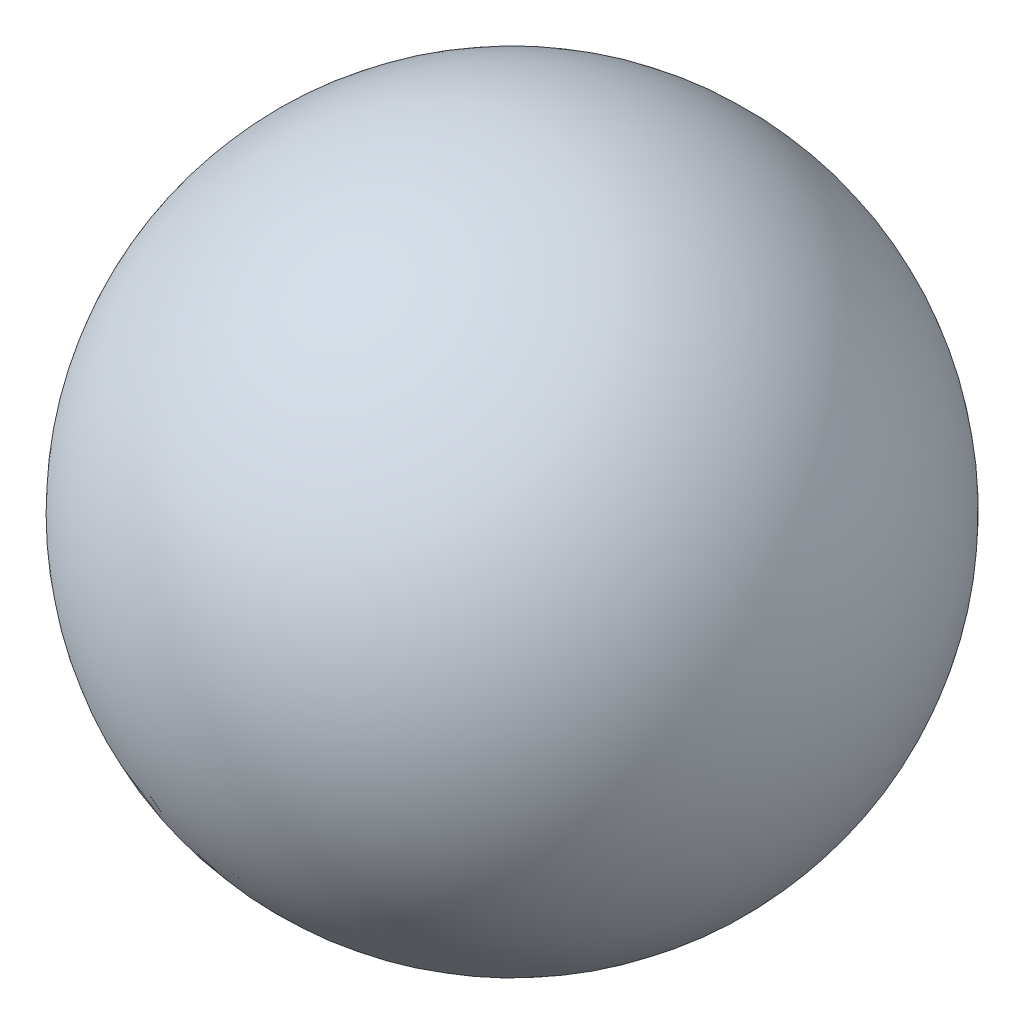
ISO-10303-21;
HEADER;
FILE_DESCRIPTION(('STEP AP214'),'2;1');
FILE_NAME('part.step','',(''),(''),'','','');
FILE_SCHEMA(('AUTOMOTIVE_DESIGN { 1 0 10303 214 1 1 1 1 }'));
ENDSEC;
DATA;
#1=APPLICATION_CONTEXT('core data for automotive mechanical design processes');
#2=APPLICATION_PROTOCOL_DEFINITION('international standard','automotive_design',2000,#1);
#3=PRODUCT_CONTEXT('',#1,'mechanical');
#4=PRODUCT('Part','Part','',(#3));
#5=PRODUCT_RELATED_PRODUCT_CATEGORY('part','',(#4));
#6=PRODUCT_DEFINITION_FORMATION('','',#4);
#7=PRODUCT_DEFINITION_CONTEXT('part definition',#1,'design');
#8=PRODUCT_DEFINITION('design','',#6,#7);
#9=PRODUCT_DEFINITION_SHAPE('','',#8);
#10=(LENGTH_UNIT() NAMED_UNIT(*) SI_UNIT(.MILLI.,.METRE.));
#11=(NAMED_UNIT(*) PLANE_ANGLE_UNIT() SI_UNIT($,.RADIAN.));
#12=(NAMED_UNIT(*) SI_UNIT($,.STERADIAN.) SOLID_ANGLE_UNIT());
#13=UNCERTAINTY_MEASURE_WITH_UNIT(LENGTH_MEASURE(1.E-05),#10,'distance_accuracy_value','');
#14=(GEOMETRIC_REPRESENTATION_CONTEXT(3) GLOBAL_UNCERTAINTY_ASSIGNED_CONTEXT((#13)) GLOBAL_UNIT_ASSIGNED_CONTEXT((#10,
#11,#12)) REPRESENTATION_CONTEXT('',''));
#15=CARTESIAN_POINT('',(0.,0.,0.));
#16=DIRECTION('',(0.,0.,1.));
#17=DIRECTION('',(1.,0.,0.));
#18=AXIS2_PLACEMENT_3D('',#15,#16,#17);
#19=CARTESIAN_POINT('',(0.,0.,0.));
#20=DIRECTION('',(0.872140249572219,0.301743891524339,0.385125965112528));
#21=DIRECTION('',(-0.189257518211814,-0.517819256459933,0.834292999754635));
#22=AXIS2_PLACEMENT_3D('',#19,#20,#21);
#23=SPHERICAL_SURFACE('',#22,0.794);
#24=CARTESIAN_POINT('',(-0.692479358160342,-0.239584649870325,-0.305790016299347));
#25=VERTEX_POINT('',#24);
#26=VERTEX_LOOP('',#25);
#27=FACE_BOUND('',#26,.T.);
#28=CARTESIAN_POINT('',(0.692479358160342,0.239584649870325,0.305790016299347));
#29=VERTEX_POINT('',#28);
#30=VERTEX_LOOP('',#29);
#31=FACE_BOUND('',#30,.T.);
#32=ADVANCED_FACE('F15',(#27,#31),#23,.T.);
#33=CLOSED_SHELL('',(#32));
#34=MANIFOLD_SOLID_BREP('B1',#33);
#35=ADVANCED_BREP_SHAPE_REPRESENTATION('',(#18,#34),#14);
#36=SHAPE_DEFINITION_REPRESENTATION(#9,#35);
ENDSEC;
END-ISO-10303-21;
